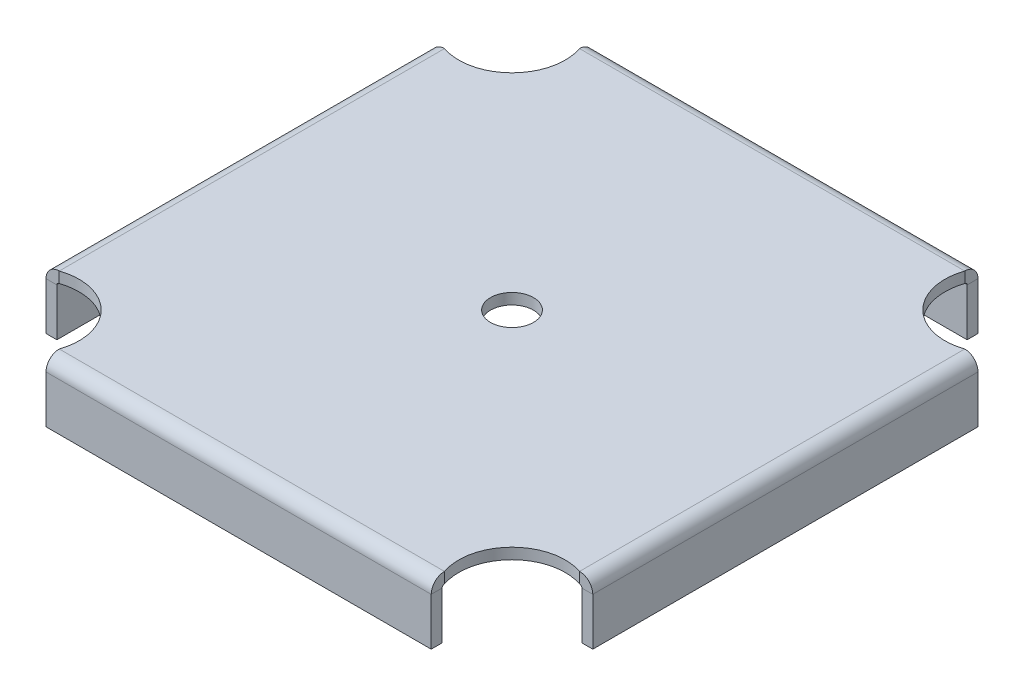
ISO-10303-21;
HEADER;
FILE_DESCRIPTION(('STEP AP214'),'2;1');
FILE_NAME('part.step','',(''),(''),'','','');
FILE_SCHEMA(('AUTOMOTIVE_DESIGN { 1 0 10303 214 1 1 1 1 }'));
ENDSEC;
DATA;
#1=APPLICATION_CONTEXT('core data for automotive mechanical design processes');
#2=APPLICATION_PROTOCOL_DEFINITION('international standard','automotive_design',2000,#1);
#3=PRODUCT_CONTEXT('',#1,'mechanical');
#4=PRODUCT('Part','Part','',(#3));
#5=PRODUCT_RELATED_PRODUCT_CATEGORY('part','',(#4));
#6=PRODUCT_DEFINITION_FORMATION('','',#4);
#7=PRODUCT_DEFINITION_CONTEXT('part definition',#1,'design');
#8=PRODUCT_DEFINITION('design','',#6,#7);
#9=PRODUCT_DEFINITION_SHAPE('','',#8);
#10=(LENGTH_UNIT() NAMED_UNIT(*) SI_UNIT(.MILLI.,.METRE.));
#11=(NAMED_UNIT(*) PLANE_ANGLE_UNIT() SI_UNIT($,.RADIAN.));
#12=(NAMED_UNIT(*) SI_UNIT($,.STERADIAN.) SOLID_ANGLE_UNIT());
#13=UNCERTAINTY_MEASURE_WITH_UNIT(LENGTH_MEASURE(1.E-05),#10,'distance_accuracy_value','');
#14=(GEOMETRIC_REPRESENTATION_CONTEXT(3) GLOBAL_UNCERTAINTY_ASSIGNED_CONTEXT((#13)) GLOBAL_UNIT_ASSIGNED_CONTEXT((#10,
#11,#12)) REPRESENTATION_CONTEXT('',''));
#15=CARTESIAN_POINT('',(0.,0.,0.));
#16=DIRECTION('',(0.,0.,1.));
#17=DIRECTION('',(1.,0.,0.));
#18=AXIS2_PLACEMENT_3D('',#15,#16,#17);
#19=CARTESIAN_POINT('',(76.2,-3.4163,76.2));
#20=DIRECTION('',(0.,1.,0.));
#21=DIRECTION('',(0.,0.,1.));
#22=AXIS2_PLACEMENT_3D('',#19,#20,#21);
#23=CYLINDRICAL_SURFACE('',#22,16.7005);
#24=CARTESIAN_POINT('',(76.2,0.,76.2));
#25=DIRECTION('',(0.,-1.,0.));
#26=DIRECTION('',(0.,0.,1.));
#27=AXIS2_PLACEMENT_3D('',#24,#25,#26);
#28=CIRCLE('',#27,16.7005);
#29=CARTESIAN_POINT('',(60.3828089759907,0.,81.5594));
#30=VERTEX_POINT('',#29);
#31=CARTESIAN_POINT('',(81.5594,0.,60.3828089759907));
#32=VERTEX_POINT('',#31);
#33=EDGE_CURVE('E465',#30,#32,#28,.T.);
#34=ORIENTED_EDGE('',*,*,#33,.F.);
#35=DIRECTION('',(0.,1.,0.));
#36=VECTOR('',#35,1.);
#37=CARTESIAN_POINT('',(60.3828089759907,-3.4163,81.5594));
#38=LINE('',#37,#36);
#39=CARTESIAN_POINT('',(60.3828089759907,-3.4163,81.5594));
#40=VERTEX_POINT('',#39);
#41=EDGE_CURVE('E13',#40,#30,#38,.T.);
#42=ORIENTED_EDGE('',*,*,#41,.F.);
#43=CARTESIAN_POINT('',(76.2,-3.4163,76.2));
#44=DIRECTION('',(0.,-1.,0.));
#45=DIRECTION('',(0.,0.,1.));
#46=AXIS2_PLACEMENT_3D('',#43,#44,#45);
#47=CIRCLE('',#46,16.7005);
#48=CARTESIAN_POINT('',(81.5594,-3.4163,60.3828089759907));
#49=VERTEX_POINT('',#48);
#50=EDGE_CURVE('E468',#40,#49,#47,.T.);
#51=ORIENTED_EDGE('',*,*,#50,.T.);
#52=DIRECTION('',(0.,1.,0.));
#53=VECTOR('',#52,1.);
#54=CARTESIAN_POINT('',(81.5594,-3.4163,60.3828089759907));
#55=LINE('',#54,#53);
#56=EDGE_CURVE('E122',#49,#32,#55,.T.);
#57=ORIENTED_EDGE('',*,*,#56,.T.);
#58=EDGE_LOOP('',(#34,#42,#51,#57));
#59=FACE_BOUND('',#58,.T.);
#60=ADVANCED_FACE('F119',(#59),#23,.F.);
#61=CARTESIAN_POINT('',(-76.2,-3.4163,76.2));
#62=DIRECTION('',(0.,1.,0.));
#63=DIRECTION('',(0.,0.,1.));
#64=AXIS2_PLACEMENT_3D('',#61,#62,#63);
#65=CYLINDRICAL_SURFACE('',#64,16.7005);
#66=CARTESIAN_POINT('',(-76.2,0.,76.2));
#67=DIRECTION('',(0.,-1.,0.));
#68=DIRECTION('',(0.,0.,1.));
#69=AXIS2_PLACEMENT_3D('',#66,#67,#68);
#70=CIRCLE('',#69,16.7005);
#71=CARTESIAN_POINT('',(-81.5594,0.,60.3828089759907));
#72=VERTEX_POINT('',#71);
#73=CARTESIAN_POINT('',(-60.3828089759907,0.,81.5594));
#74=VERTEX_POINT('',#73);
#75=EDGE_CURVE('E506',#72,#74,#70,.T.);
#76=ORIENTED_EDGE('',*,*,#75,.F.);
#77=DIRECTION('',(0.,1.,0.));
#78=VECTOR('',#77,1.);
#79=CARTESIAN_POINT('',(-81.5594,-3.4163,60.3828089759907));
#80=LINE('',#79,#78);
#81=CARTESIAN_POINT('',(-81.5594,-3.4163,60.3828089759907));
#82=VERTEX_POINT('',#81);
#83=EDGE_CURVE('E513',#82,#72,#80,.T.);
#84=ORIENTED_EDGE('',*,*,#83,.F.);
#85=CARTESIAN_POINT('',(-76.2,-3.4163,76.2));
#86=DIRECTION('',(0.,-1.,0.));
#87=DIRECTION('',(0.,0.,1.));
#88=AXIS2_PLACEMENT_3D('',#85,#86,#87);
#89=CIRCLE('',#88,16.7005);
#90=CARTESIAN_POINT('',(-60.3828089759907,-3.4163,81.5594));
#91=VERTEX_POINT('',#90);
#92=EDGE_CURVE('E484',#82,#91,#89,.T.);
#93=ORIENTED_EDGE('',*,*,#92,.T.);
#94=DIRECTION('',(0.,1.,0.));
#95=VECTOR('',#94,1.);
#96=CARTESIAN_POINT('',(-60.3828089759907,-3.4163,81.5594));
#97=LINE('',#96,#95);
#98=EDGE_CURVE('E127',#91,#74,#97,.T.);
#99=ORIENTED_EDGE('',*,*,#98,.T.);
#100=EDGE_LOOP('',(#76,#84,#93,#99));
#101=FACE_BOUND('',#100,.T.);
#102=ADVANCED_FACE('F545',(#101),#65,.F.);
#103=CARTESIAN_POINT('',(-76.2,-3.4163,-76.2));
#104=DIRECTION('',(0.,1.,0.));
#105=DIRECTION('',(0.,0.,1.));
#106=AXIS2_PLACEMENT_3D('',#103,#104,#105);
#107=CYLINDRICAL_SURFACE('',#106,16.7005);
#108=CARTESIAN_POINT('',(-76.2,0.,-76.2));
#109=DIRECTION('',(0.,-1.,0.));
#110=DIRECTION('',(0.,0.,1.));
#111=AXIS2_PLACEMENT_3D('',#108,#109,#110);
#112=CIRCLE('',#111,16.7005);
#113=CARTESIAN_POINT('',(-60.3828089759907,0.,-81.5594));
#114=VERTEX_POINT('',#113);
#115=CARTESIAN_POINT('',(-81.5594,0.,-60.3828089759907));
#116=VERTEX_POINT('',#115);
#117=EDGE_CURVE('E500',#114,#116,#112,.T.);
#118=ORIENTED_EDGE('',*,*,#117,.F.);
#119=DIRECTION('',(0.,1.,0.));
#120=VECTOR('',#119,1.);
#121=CARTESIAN_POINT('',(-60.3828089759907,-3.4163,-81.5594));
#122=LINE('',#121,#120);
#123=CARTESIAN_POINT('',(-60.3828089759907,-3.41630000000001,-81.5594));
#124=VERTEX_POINT('',#123);
#125=EDGE_CURVE('E518',#124,#114,#122,.T.);
#126=ORIENTED_EDGE('',*,*,#125,.F.);
#127=CARTESIAN_POINT('',(-76.2,-3.4163,-76.2));
#128=DIRECTION('',(0.,-1.,0.));
#129=DIRECTION('',(0.,0.,1.));
#130=AXIS2_PLACEMENT_3D('',#127,#128,#129);
#131=CIRCLE('',#130,16.7005);
#132=CARTESIAN_POINT('',(-81.5594,-3.4163,-60.3828089759907));
#133=VERTEX_POINT('',#132);
#134=EDGE_CURVE('E479',#124,#133,#131,.T.);
#135=ORIENTED_EDGE('',*,*,#134,.T.);
#136=DIRECTION('',(0.,1.,0.));
#137=VECTOR('',#136,1.);
#138=CARTESIAN_POINT('',(-81.5594,-3.4163,-60.3828089759907));
#139=LINE('',#138,#137);
#140=EDGE_CURVE('E515',#133,#116,#139,.T.);
#141=ORIENTED_EDGE('',*,*,#140,.T.);
#142=EDGE_LOOP('',(#118,#126,#135,#141));
#143=FACE_BOUND('',#142,.T.);
#144=ADVANCED_FACE('F591',(#143),#107,.F.);
#145=CARTESIAN_POINT('',(76.2,-3.4163,-76.2));
#146=DIRECTION('',(0.,1.,0.));
#147=DIRECTION('',(0.,0.,1.));
#148=AXIS2_PLACEMENT_3D('',#145,#146,#147);
#149=CYLINDRICAL_SURFACE('',#148,16.7005);
#150=CARTESIAN_POINT('',(76.2,0.,-76.2));
#151=DIRECTION('',(0.,-1.,0.));
#152=DIRECTION('',(0.,0.,1.));
#153=AXIS2_PLACEMENT_3D('',#150,#151,#152);
#154=CIRCLE('',#153,16.7005);
#155=CARTESIAN_POINT('',(81.5594,0.,-60.3828089759907));
#156=VERTEX_POINT('',#155);
#157=CARTESIAN_POINT('',(60.3828089759907,0.,-81.5594));
#158=VERTEX_POINT('',#157);
#159=EDGE_CURVE('E494',#156,#158,#154,.T.);
#160=ORIENTED_EDGE('',*,*,#159,.F.);
#161=DIRECTION('',(0.,1.,0.));
#162=VECTOR('',#161,1.);
#163=CARTESIAN_POINT('',(81.5594,-3.4163,-60.3828089759907));
#164=LINE('',#163,#162);
#165=CARTESIAN_POINT('',(81.5594,-3.4163,-60.3828089759907));
#166=VERTEX_POINT('',#165);
#167=EDGE_CURVE('E523',#166,#156,#164,.T.);
#168=ORIENTED_EDGE('',*,*,#167,.F.);
#169=CARTESIAN_POINT('',(76.2,-3.4163,-76.2));
#170=DIRECTION('',(0.,-1.,0.));
#171=DIRECTION('',(0.,0.,1.));
#172=AXIS2_PLACEMENT_3D('',#169,#170,#171);
#173=CIRCLE('',#172,16.7005);
#174=CARTESIAN_POINT('',(60.3828089759907,-3.41630000000001,-81.5594));
#175=VERTEX_POINT('',#174);
#176=EDGE_CURVE('E474',#166,#175,#173,.T.);
#177=ORIENTED_EDGE('',*,*,#176,.T.);
#178=DIRECTION('',(0.,1.,0.));
#179=VECTOR('',#178,1.);
#180=CARTESIAN_POINT('',(60.3828089759907,-3.4163,-81.5594));
#181=LINE('',#180,#179);
#182=EDGE_CURVE('E521',#175,#158,#181,.T.);
#183=ORIENTED_EDGE('',*,*,#182,.T.);
#184=EDGE_LOOP('',(#160,#168,#177,#183));
#185=FACE_BOUND('',#184,.T.);
#186=ADVANCED_FACE('F596',(#185),#149,.F.);
#187=CARTESIAN_POINT('',(76.2,-3.4163,76.2));
#188=DIRECTION('',(0.,1.,0.));
#189=DIRECTION('',(0.,0.,1.));
#190=AXIS2_PLACEMENT_3D('',#187,#188,#189);
#191=PLANE('',#190);
#192=CARTESIAN_POINT('',(0.,-3.4163,0.));
#193=DIRECTION('',(0.,1.,0.));
#194=DIRECTION('',(0.,0.,1.));
#195=AXIS2_PLACEMENT_3D('',#192,#193,#194);
#196=CIRCLE('',#195,6.7437);
#197=CARTESIAN_POINT('',(0.,-3.4163,6.7437));
#198=VERTEX_POINT('',#197);
#199=EDGE_CURVE('E462',#198,#198,#196,.T.);
#200=ORIENTED_EDGE('',*,*,#199,.T.);
#201=EDGE_LOOP('',(#200));
#202=FACE_BOUND('',#201,.T.);
#203=ORIENTED_EDGE('',*,*,#50,.F.);
#204=DIRECTION('',(1.,0.,0.));
#205=VECTOR('',#204,1.);
#206=CARTESIAN_POINT('',(60.3828089759907,-3.4163,81.5594));
#207=LINE('',#206,#205);
#208=EDGE_CURVE('E487',#91,#40,#207,.T.);
#209=ORIENTED_EDGE('',*,*,#208,.F.);
#210=ORIENTED_EDGE('',*,*,#92,.F.);
#211=DIRECTION('',(0.,0.,1.));
#212=VECTOR('',#211,1.);
#213=CARTESIAN_POINT('',(-81.5594,-3.4163,60.3828089759907));
#214=LINE('',#213,#212);
#215=EDGE_CURVE('E482',#133,#82,#214,.T.);
#216=ORIENTED_EDGE('',*,*,#215,.F.);
#217=ORIENTED_EDGE('',*,*,#134,.F.);
#218=DIRECTION('',(-1.,0.,0.));
#219=VECTOR('',#218,1.);
#220=CARTESIAN_POINT('',(-60.3828089759907,-3.4163,-81.5594));
#221=LINE('',#220,#219);
#222=EDGE_CURVE('E477',#175,#124,#221,.T.);
#223=ORIENTED_EDGE('',*,*,#222,.F.);
#224=ORIENTED_EDGE('',*,*,#176,.F.);
#225=DIRECTION('',(0.,0.,-1.));
#226=VECTOR('',#225,1.);
#227=CARTESIAN_POINT('',(81.5594,-3.4163,-60.3828089759907));
#228=LINE('',#227,#226);
#229=EDGE_CURVE('E471',#49,#166,#228,.T.);
#230=ORIENTED_EDGE('',*,*,#229,.F.);
#231=EDGE_LOOP('',(#203,#209,#210,#216,#217,#223,#224,#230));
#232=FACE_BOUND('',#231,.T.);
#233=ADVANCED_FACE('F551',(#202,#232),#191,.F.);
#234=CARTESIAN_POINT('',(76.2,0.,76.2));
#235=DIRECTION('',(0.,1.,0.));
#236=DIRECTION('',(0.,0.,1.));
#237=AXIS2_PLACEMENT_3D('',#234,#235,#236);
#238=PLANE('',#237);
#239=CARTESIAN_POINT('',(0.,0.,0.));
#240=DIRECTION('',(0.,1.,0.));
#241=DIRECTION('',(0.,0.,1.));
#242=AXIS2_PLACEMENT_3D('',#239,#240,#241);
#243=CIRCLE('',#242,6.7437);
#244=CARTESIAN_POINT('',(0.,0.,6.7437));
#245=VERTEX_POINT('',#244);
#246=EDGE_CURVE('E453',#245,#245,#243,.T.);
#247=ORIENTED_EDGE('',*,*,#246,.F.);
#248=EDGE_LOOP('',(#247));
#249=FACE_BOUND('',#248,.T.);
#250=ORIENTED_EDGE('',*,*,#33,.T.);
#251=DIRECTION('',(0.,0.,-1.));
#252=VECTOR('',#251,1.);
#253=CARTESIAN_POINT('',(81.5594,0.,-60.3828089759907));
#254=LINE('',#253,#252);
#255=EDGE_CURVE('E491',#32,#156,#254,.T.);
#256=ORIENTED_EDGE('',*,*,#255,.T.);
#257=ORIENTED_EDGE('',*,*,#159,.T.);
#258=DIRECTION('',(-1.,0.,0.));
#259=VECTOR('',#258,1.);
#260=CARTESIAN_POINT('',(-60.3828089759907,0.,-81.5594));
#261=LINE('',#260,#259);
#262=EDGE_CURVE('E497',#158,#114,#261,.T.);
#263=ORIENTED_EDGE('',*,*,#262,.T.);
#264=ORIENTED_EDGE('',*,*,#117,.T.);
#265=DIRECTION('',(0.,0.,1.));
#266=VECTOR('',#265,1.);
#267=CARTESIAN_POINT('',(-81.5594,0.,60.3828089759907));
#268=LINE('',#267,#266);
#269=EDGE_CURVE('E503',#116,#72,#268,.T.);
#270=ORIENTED_EDGE('',*,*,#269,.T.);
#271=ORIENTED_EDGE('',*,*,#75,.T.);
#272=DIRECTION('',(1.,0.,0.));
#273=VECTOR('',#272,1.);
#274=CARTESIAN_POINT('',(60.3828089759907,0.,81.5594));
#275=LINE('',#274,#273);
#276=EDGE_CURVE('E472',#74,#30,#275,.T.);
#277=ORIENTED_EDGE('',*,*,#276,.T.);
#278=EDGE_LOOP('',(#250,#256,#257,#263,#264,#270,#271,#277));
#279=FACE_BOUND('',#278,.T.);
#280=ADVANCED_FACE('F537',(#249,#279),#238,.T.);
#281=CARTESIAN_POINT('',(0.,-3.4163,0.));
#282=DIRECTION('',(0.,1.,0.));
#283=DIRECTION('',(0.,0.,1.));
#284=AXIS2_PLACEMENT_3D('',#281,#282,#283);
#285=CYLINDRICAL_SURFACE('',#284,6.7437);
#286=ORIENTED_EDGE('',*,*,#199,.F.);
#287=EDGE_LOOP('',(#286));
#288=FACE_BOUND('',#287,.T.);
#289=ORIENTED_EDGE('',*,*,#246,.T.);
#290=EDGE_LOOP('',(#289));
#291=FACE_BOUND('',#290,.T.);
#292=ADVANCED_FACE('F710',(#288,#291),#285,.F.);
#293=CARTESIAN_POINT('',(60.3828089759907,-4.1529,81.5594));
#294=DIRECTION('',(1.,0.,0.));
#295=DIRECTION('',(0.,0.,-1.));
#296=AXIS2_PLACEMENT_3D('',#293,#294,#295);
#297=PLANE('',#296);
#298=DIRECTION('',(0.,0.,1.));
#299=VECTOR('',#298,1.);
#300=CARTESIAN_POINT('',(60.3828089759907,-4.1529,85.7123));
#301=LINE('',#300,#299);
#302=CARTESIAN_POINT('',(60.3828089759907,-4.1529,82.296));
#303=VERTEX_POINT('',#302);
#304=CARTESIAN_POINT('',(60.3828089759907,-4.15289999999999,85.7123));
#305=VERTEX_POINT('',#304);
#306=EDGE_CURVE('E411',#303,#305,#301,.T.);
#307=ORIENTED_EDGE('',*,*,#306,.F.);
#308=CARTESIAN_POINT('',(60.3828089759907,-4.1529,81.5594));
#309=DIRECTION('',(-1.,0.,0.));
#310=DIRECTION('',(0.,0.,1.));
#311=AXIS2_PLACEMENT_3D('',#308,#309,#310);
#312=CIRCLE('',#311,0.736600000000004);
#313=EDGE_CURVE('E457',#40,#303,#312,.F.);
#314=ORIENTED_EDGE('',*,*,#313,.F.);
#315=ORIENTED_EDGE('',*,*,#41,.T.);
#316=CARTESIAN_POINT('',(60.3828089759907,-4.1529,81.5594));
#317=DIRECTION('',(-1.,0.,0.));
#318=DIRECTION('',(0.,0.,1.));
#319=AXIS2_PLACEMENT_3D('',#316,#317,#318);
#320=CIRCLE('',#319,4.1529);
#321=EDGE_CURVE('E135',#30,#305,#320,.F.);
#322=ORIENTED_EDGE('',*,*,#321,.T.);
#323=EDGE_LOOP('',(#307,#314,#315,#322));
#324=FACE_BOUND('',#323,.T.);
#325=ADVANCED_FACE('F558',(#324),#297,.T.);
#326=CARTESIAN_POINT('',(-60.3828089759907,-4.1529,81.5594));
#327=DIRECTION('',(1.,0.,0.));
#328=DIRECTION('',(0.,0.,-1.));
#329=AXIS2_PLACEMENT_3D('',#326,#327,#328);
#330=PLANE('',#329);
#331=CARTESIAN_POINT('',(-60.3828089759907,-4.1529,81.5594));
#332=DIRECTION('',(-1.,0.,0.));
#333=DIRECTION('',(0.,0.,1.));
#334=AXIS2_PLACEMENT_3D('',#331,#332,#333);
#335=CIRCLE('',#334,0.736600000000004);
#336=CARTESIAN_POINT('',(-60.3828089759907,-4.1529,82.296));
#337=VERTEX_POINT('',#336);
#338=EDGE_CURVE('E422',#337,#91,#335,.T.);
#339=ORIENTED_EDGE('',*,*,#338,.F.);
#340=DIRECTION('',(0.,0.,1.));
#341=VECTOR('',#340,1.);
#342=CARTESIAN_POINT('',(-60.3828089759907,-4.1529,82.296));
#343=LINE('',#342,#341);
#344=CARTESIAN_POINT('',(-60.3828089759907,-4.1529,85.7123));
#345=VERTEX_POINT('',#344);
#346=EDGE_CURVE('E445',#337,#345,#343,.T.);
#347=ORIENTED_EDGE('',*,*,#346,.T.);
#348=CARTESIAN_POINT('',(-60.3828089759907,-4.1529,81.5594));
#349=DIRECTION('',(-1.,0.,0.));
#350=DIRECTION('',(0.,0.,1.));
#351=AXIS2_PLACEMENT_3D('',#348,#349,#350);
#352=CIRCLE('',#351,4.1529);
#353=EDGE_CURVE('E454',#345,#74,#352,.T.);
#354=ORIENTED_EDGE('',*,*,#353,.T.);
#355=ORIENTED_EDGE('',*,*,#98,.F.);
#356=EDGE_LOOP('',(#339,#347,#354,#355));
#357=FACE_BOUND('',#356,.T.);
#358=ADVANCED_FACE('F542',(#357),#330,.F.);
#359=CARTESIAN_POINT('',(-60.3828089759907,-4.1529,81.5594));
#360=DIRECTION('',(-1.,0.,0.));
#361=DIRECTION('',(0.,0.,1.));
#362=AXIS2_PLACEMENT_3D('',#359,#360,#361);
#363=CYLINDRICAL_SURFACE('',#362,4.1529);
#364=ORIENTED_EDGE('',*,*,#276,.F.);
#365=ORIENTED_EDGE('',*,*,#353,.F.);
#366=DIRECTION('',(-1.,0.,0.));
#367=VECTOR('',#366,1.);
#368=CARTESIAN_POINT('',(0.,-4.1529,85.7123));
#369=LINE('',#368,#367);
#370=EDGE_CURVE('E442',#305,#345,#369,.T.);
#371=ORIENTED_EDGE('',*,*,#370,.F.);
#372=ORIENTED_EDGE('',*,*,#321,.F.);
#373=EDGE_LOOP('',(#364,#365,#371,#372));
#374=FACE_BOUND('',#373,.T.);
#375=ADVANCED_FACE('F539',(#374),#363,.T.);
#376=CARTESIAN_POINT('',(-60.3828089759907,-4.1529,81.5594));
#377=DIRECTION('',(-1.,0.,0.));
#378=DIRECTION('',(0.,0.,1.));
#379=AXIS2_PLACEMENT_3D('',#376,#377,#378);
#380=CYLINDRICAL_SURFACE('',#379,0.736600000000004);
#381=ORIENTED_EDGE('',*,*,#208,.T.);
#382=ORIENTED_EDGE('',*,*,#313,.T.);
#383=DIRECTION('',(1.,0.,0.));
#384=VECTOR('',#383,1.);
#385=CARTESIAN_POINT('',(60.3828089759907,-4.1529,82.296));
#386=LINE('',#385,#384);
#387=EDGE_CURVE('E448',#303,#337,#386,.F.);
#388=ORIENTED_EDGE('',*,*,#387,.T.);
#389=ORIENTED_EDGE('',*,*,#338,.T.);
#390=EDGE_LOOP('',(#381,#382,#388,#389));
#391=FACE_BOUND('',#390,.T.);
#392=ADVANCED_FACE('F555',(#391),#380,.F.);
#393=CARTESIAN_POINT('',(-60.3828089759907,-3.41629999999999,85.7123));
#394=DIRECTION('',(-1.,0.,0.));
#395=DIRECTION('',(0.,0.,1.));
#396=AXIS2_PLACEMENT_3D('',#393,#394,#395);
#397=PLANE('',#396);
#398=DIRECTION('',(0.,1.,0.));
#399=VECTOR('',#398,1.);
#400=CARTESIAN_POINT('',(-60.3828089759907,-3.41629999999999,85.7123));
#401=LINE('',#400,#399);
#402=CARTESIAN_POINT('',(-60.3828089759907,-19.05,85.7123));
#403=VERTEX_POINT('',#402);
#404=EDGE_CURVE('E426',#403,#345,#401,.T.);
#405=ORIENTED_EDGE('',*,*,#404,.T.);
#406=ORIENTED_EDGE('',*,*,#346,.F.);
#407=DIRECTION('',(0.,-1.,0.));
#408=VECTOR('',#407,1.);
#409=CARTESIAN_POINT('',(-60.3828089759907,2.17196961742773E-13,82.296));
#410=LINE('',#409,#408);
#411=CARTESIAN_POINT('',(-60.3828089759907,-19.05,82.296));
#412=VERTEX_POINT('',#411);
#413=EDGE_CURVE('E434',#412,#337,#410,.F.);
#414=ORIENTED_EDGE('',*,*,#413,.F.);
#415=DIRECTION('',(0.,0.,-1.));
#416=VECTOR('',#415,1.);
#417=CARTESIAN_POINT('',(-60.3828089759907,-19.05,85.7123));
#418=LINE('',#417,#416);
#419=EDGE_CURVE('E420',#403,#412,#418,.T.);
#420=ORIENTED_EDGE('',*,*,#419,.F.);
#421=EDGE_LOOP('',(#405,#406,#414,#420));
#422=FACE_BOUND('',#421,.T.);
#423=ADVANCED_FACE('F575',(#422),#397,.T.);
#424=CARTESIAN_POINT('',(60.3828089759907,-19.05,85.7123));
#425=DIRECTION('',(1.,0.,0.));
#426=DIRECTION('',(0.,0.,-1.));
#427=AXIS2_PLACEMENT_3D('',#424,#425,#426);
#428=PLANE('',#427);
#429=DIRECTION('',(0.,1.,0.));
#430=VECTOR('',#429,1.);
#431=CARTESIAN_POINT('',(60.3828089759907,2.17196961742773E-13,82.296));
#432=LINE('',#431,#430);
#433=CARTESIAN_POINT('',(60.3828089759907,-19.05,82.296));
#434=VERTEX_POINT('',#433);
#435=EDGE_CURVE('E440',#303,#434,#432,.F.);
#436=ORIENTED_EDGE('',*,*,#435,.F.);
#437=ORIENTED_EDGE('',*,*,#306,.T.);
#438=DIRECTION('',(0.,-1.,0.));
#439=VECTOR('',#438,1.);
#440=CARTESIAN_POINT('',(60.3828089759907,-19.05,85.7123));
#441=LINE('',#440,#439);
#442=CARTESIAN_POINT('',(60.3828089759907,-19.05,85.7123));
#443=VERTEX_POINT('',#442);
#444=EDGE_CURVE('E432',#305,#443,#441,.T.);
#445=ORIENTED_EDGE('',*,*,#444,.T.);
#446=DIRECTION('',(0.,0.,-1.));
#447=VECTOR('',#446,1.);
#448=CARTESIAN_POINT('',(60.3828089759907,-19.05,85.7123));
#449=LINE('',#448,#447);
#450=EDGE_CURVE('E423',#443,#434,#449,.T.);
#451=ORIENTED_EDGE('',*,*,#450,.T.);
#452=EDGE_LOOP('',(#436,#437,#445,#451));
#453=FACE_BOUND('',#452,.T.);
#454=ADVANCED_FACE('F562',(#453),#428,.T.);
#455=CARTESIAN_POINT('',(0.,2.29124909440663E-13,85.7123));
#456=DIRECTION('',(0.,0.,1.));
#457=DIRECTION('',(0.,-1.,0.));
#458=AXIS2_PLACEMENT_3D('',#455,#456,#457);
#459=PLANE('',#458);
#460=ORIENTED_EDGE('',*,*,#444,.F.);
#461=ORIENTED_EDGE('',*,*,#370,.T.);
#462=ORIENTED_EDGE('',*,*,#404,.F.);
#463=DIRECTION('',(-1.,0.,0.));
#464=VECTOR('',#463,1.);
#465=CARTESIAN_POINT('',(-60.3828089759907,-19.05,85.7123));
#466=LINE('',#465,#464);
#467=EDGE_CURVE('E429',#443,#403,#466,.T.);
#468=ORIENTED_EDGE('',*,*,#467,.F.);
#469=EDGE_LOOP('',(#460,#461,#462,#468));
#470=FACE_BOUND('',#469,.T.);
#471=ADVANCED_FACE('F566',(#470),#459,.T.);
#472=CARTESIAN_POINT('',(0.,2.17196961742773E-13,82.296));
#473=DIRECTION('',(0.,0.,1.));
#474=DIRECTION('',(0.,-1.,0.));
#475=AXIS2_PLACEMENT_3D('',#472,#473,#474);
#476=PLANE('',#475);
#477=ORIENTED_EDGE('',*,*,#387,.F.);
#478=ORIENTED_EDGE('',*,*,#435,.T.);
#479=DIRECTION('',(1.,0.,0.));
#480=VECTOR('',#479,1.);
#481=CARTESIAN_POINT('',(0.,-19.05,82.296));
#482=LINE('',#481,#480);
#483=EDGE_CURVE('E437',#434,#412,#482,.F.);
#484=ORIENTED_EDGE('',*,*,#483,.T.);
#485=ORIENTED_EDGE('',*,*,#413,.T.);
#486=EDGE_LOOP('',(#477,#478,#484,#485));
#487=FACE_BOUND('',#486,.T.);
#488=ADVANCED_FACE('F573',(#487),#476,.F.);
#489=CARTESIAN_POINT('',(-60.3828089759907,-19.05,85.7123));
#490=DIRECTION('',(0.,-1.,0.));
#491=DIRECTION('',(0.,0.,-1.));
#492=AXIS2_PLACEMENT_3D('',#489,#490,#491);
#493=PLANE('',#492);
#494=ORIENTED_EDGE('',*,*,#483,.F.);
#495=ORIENTED_EDGE('',*,*,#450,.F.);
#496=ORIENTED_EDGE('',*,*,#467,.T.);
#497=ORIENTED_EDGE('',*,*,#419,.T.);
#498=EDGE_LOOP('',(#494,#495,#496,#497));
#499=FACE_BOUND('',#498,.T.);
#500=ADVANCED_FACE('F570',(#499),#493,.T.);
#501=CARTESIAN_POINT('',(81.5594,-4.1529,-60.3828089759907));
#502=DIRECTION('',(0.,0.,-1.));
#503=DIRECTION('',(-1.,0.,0.));
#504=AXIS2_PLACEMENT_3D('',#501,#502,#503);
#505=PLANE('',#504);
#506=DIRECTION('',(1.,0.,0.));
#507=VECTOR('',#506,1.);
#508=CARTESIAN_POINT('',(85.7123,-4.15289999999999,-60.3828089759907));
#509=LINE('',#508,#507);
#510=CARTESIAN_POINT('',(82.296,-4.1529,-60.3828089759907));
#511=VERTEX_POINT('',#510);
#512=CARTESIAN_POINT('',(85.7123,-4.15289999999999,-60.3828089759907));
#513=VERTEX_POINT('',#512);
#514=EDGE_CURVE('E368',#511,#513,#509,.T.);
#515=ORIENTED_EDGE('',*,*,#514,.F.);
#516=CARTESIAN_POINT('',(81.5594,-4.1529,-60.3828089759907));
#517=DIRECTION('',(0.,0.,1.));
#518=DIRECTION('',(1.,0.,0.));
#519=AXIS2_PLACEMENT_3D('',#516,#517,#518);
#520=CIRCLE('',#519,0.736600000000004);
#521=EDGE_CURVE('E415',#166,#511,#520,.F.);
#522=ORIENTED_EDGE('',*,*,#521,.F.);
#523=ORIENTED_EDGE('',*,*,#167,.T.);
#524=CARTESIAN_POINT('',(81.5594,-4.1529,-60.3828089759907));
#525=DIRECTION('',(0.,0.,1.));
#526=DIRECTION('',(1.,0.,0.));
#527=AXIS2_PLACEMENT_3D('',#524,#525,#526);
#528=CIRCLE('',#527,4.1529);
#529=EDGE_CURVE('E408',#156,#513,#528,.F.);
#530=ORIENTED_EDGE('',*,*,#529,.T.);
#531=EDGE_LOOP('',(#515,#522,#523,#530));
#532=FACE_BOUND('',#531,.T.);
#533=ADVANCED_FACE('F693',(#532),#505,.T.);
#534=CARTESIAN_POINT('',(81.5594,-4.1529,60.3828089759907));
#535=DIRECTION('',(0.,0.,-1.));
#536=DIRECTION('',(-1.,0.,0.));
#537=AXIS2_PLACEMENT_3D('',#534,#535,#536);
#538=PLANE('',#537);
#539=CARTESIAN_POINT('',(81.5594,-4.1529,60.3828089759907));
#540=DIRECTION('',(0.,0.,1.));
#541=DIRECTION('',(1.,0.,0.));
#542=AXIS2_PLACEMENT_3D('',#539,#540,#541);
#543=CIRCLE('',#542,0.736600000000004);
#544=CARTESIAN_POINT('',(82.296,-4.1529,60.3828089759907));
#545=VERTEX_POINT('',#544);
#546=EDGE_CURVE('E379',#545,#49,#543,.T.);
#547=ORIENTED_EDGE('',*,*,#546,.F.);
#548=DIRECTION('',(1.,0.,0.));
#549=VECTOR('',#548,1.);
#550=CARTESIAN_POINT('',(82.296,-4.1529,60.3828089759907));
#551=LINE('',#550,#549);
#552=CARTESIAN_POINT('',(85.7123,-4.15289999999999,60.3828089759907));
#553=VERTEX_POINT('',#552);
#554=EDGE_CURVE('E401',#545,#553,#551,.T.);
#555=ORIENTED_EDGE('',*,*,#554,.T.);
#556=CARTESIAN_POINT('',(81.5594,-4.1529,60.3828089759907));
#557=DIRECTION('',(0.,0.,1.));
#558=DIRECTION('',(1.,0.,0.));
#559=AXIS2_PLACEMENT_3D('',#556,#557,#558);
#560=CIRCLE('',#559,4.1529);
#561=EDGE_CURVE('E412',#553,#32,#560,.T.);
#562=ORIENTED_EDGE('',*,*,#561,.T.);
#563=ORIENTED_EDGE('',*,*,#56,.F.);
#564=EDGE_LOOP('',(#547,#555,#562,#563));
#565=FACE_BOUND('',#564,.T.);
#566=ADVANCED_FACE('F688',(#565),#538,.F.);
#567=CARTESIAN_POINT('',(81.5594,-4.1529,60.3828089759907));
#568=DIRECTION('',(0.,0.,1.));
#569=DIRECTION('',(1.,0.,0.));
#570=AXIS2_PLACEMENT_3D('',#567,#568,#569);
#571=CYLINDRICAL_SURFACE('',#570,4.1529);
#572=ORIENTED_EDGE('',*,*,#255,.F.);
#573=ORIENTED_EDGE('',*,*,#561,.F.);
#574=DIRECTION('',(0.,0.,1.));
#575=VECTOR('',#574,1.);
#576=CARTESIAN_POINT('',(85.7123,-4.15289999999999,-60.3828089759907));
#577=LINE('',#576,#575);
#578=EDGE_CURVE('E399',#553,#513,#577,.F.);
#579=ORIENTED_EDGE('',*,*,#578,.T.);
#580=ORIENTED_EDGE('',*,*,#529,.F.);
#581=EDGE_LOOP('',(#572,#573,#579,#580));
#582=FACE_BOUND('',#581,.T.);
#583=ADVANCED_FACE('F685',(#582),#571,.T.);
#584=CARTESIAN_POINT('',(81.5594,-4.1529,60.3828089759907));
#585=DIRECTION('',(0.,0.,1.));
#586=DIRECTION('',(1.,0.,0.));
#587=AXIS2_PLACEMENT_3D('',#584,#585,#586);
#588=CYLINDRICAL_SURFACE('',#587,0.736600000000004);
#589=ORIENTED_EDGE('',*,*,#229,.T.);
#590=ORIENTED_EDGE('',*,*,#521,.T.);
#591=DIRECTION('',(0.,0.,1.));
#592=VECTOR('',#591,1.);
#593=CARTESIAN_POINT('',(82.296,-4.1529,-60.3828089759907));
#594=LINE('',#593,#592);
#595=EDGE_CURVE('E404',#511,#545,#594,.T.);
#596=ORIENTED_EDGE('',*,*,#595,.T.);
#597=ORIENTED_EDGE('',*,*,#546,.T.);
#598=EDGE_LOOP('',(#589,#590,#596,#597));
#599=FACE_BOUND('',#598,.T.);
#600=ADVANCED_FACE('F683',(#599),#588,.F.);
#601=CARTESIAN_POINT('',(85.7123,-3.41629999999999,-60.3828089759907));
#602=DIRECTION('',(0.,0.,-1.));
#603=DIRECTION('',(-1.,0.,0.));
#604=AXIS2_PLACEMENT_3D('',#601,#602,#603);
#605=PLANE('',#604);
#606=DIRECTION('',(0.,-1.,0.));
#607=VECTOR('',#606,1.);
#608=CARTESIAN_POINT('',(82.296,2.89595948990364E-13,-60.3828089759907));
#609=LINE('',#608,#607);
#610=CARTESIAN_POINT('',(82.2960000000001,-19.05,-60.3828089759907));
#611=VERTEX_POINT('',#610);
#612=EDGE_CURVE('E397',#511,#611,#609,.T.);
#613=ORIENTED_EDGE('',*,*,#612,.F.);
#614=ORIENTED_EDGE('',*,*,#514,.T.);
#615=DIRECTION('',(0.,1.,0.));
#616=VECTOR('',#615,1.);
#617=CARTESIAN_POINT('',(85.7123,-3.41629999999999,-60.3828089759907));
#618=LINE('',#617,#616);
#619=CARTESIAN_POINT('',(85.7123000000001,-19.05,-60.3828089759907));
#620=VERTEX_POINT('',#619);
#621=EDGE_CURVE('E389',#513,#620,#618,.F.);
#622=ORIENTED_EDGE('',*,*,#621,.T.);
#623=DIRECTION('',(-1.,0.,0.));
#624=VECTOR('',#623,1.);
#625=CARTESIAN_POINT('',(85.7123000000001,-19.05,-60.3828089759907));
#626=LINE('',#625,#624);
#627=EDGE_CURVE('E380',#620,#611,#626,.T.);
#628=ORIENTED_EDGE('',*,*,#627,.T.);
#629=EDGE_LOOP('',(#613,#614,#622,#628));
#630=FACE_BOUND('',#629,.T.);
#631=ADVANCED_FACE('F676',(#630),#605,.T.);
#632=CARTESIAN_POINT('',(85.7123000000001,-19.05,60.3828089759907));
#633=DIRECTION('',(0.,0.,1.));
#634=DIRECTION('',(0.,-1.,0.));
#635=AXIS2_PLACEMENT_3D('',#632,#633,#634);
#636=PLANE('',#635);
#637=DIRECTION('',(0.,-1.,0.));
#638=VECTOR('',#637,1.);
#639=CARTESIAN_POINT('',(85.7123000000001,-19.05,60.3828089759907));
#640=LINE('',#639,#638);
#641=CARTESIAN_POINT('',(85.7123000000001,-19.05,60.3828089759907));
#642=VERTEX_POINT('',#641);
#643=EDGE_CURVE('E383',#642,#553,#640,.F.);
#644=ORIENTED_EDGE('',*,*,#643,.T.);
#645=ORIENTED_EDGE('',*,*,#554,.F.);
#646=DIRECTION('',(0.,1.,0.));
#647=VECTOR('',#646,1.);
#648=CARTESIAN_POINT('',(82.296,3.16396380436809E-13,60.3828089759907));
#649=LINE('',#648,#647);
#650=CARTESIAN_POINT('',(82.2960000000001,-19.05,60.3828089759907));
#651=VERTEX_POINT('',#650);
#652=EDGE_CURVE('E391',#651,#545,#649,.T.);
#653=ORIENTED_EDGE('',*,*,#652,.F.);
#654=DIRECTION('',(-1.,0.,0.));
#655=VECTOR('',#654,1.);
#656=CARTESIAN_POINT('',(85.7123000000001,-19.05,60.3828089759907));
#657=LINE('',#656,#655);
#658=EDGE_CURVE('E377',#642,#651,#657,.T.);
#659=ORIENTED_EDGE('',*,*,#658,.F.);
#660=EDGE_LOOP('',(#644,#645,#653,#659));
#661=FACE_BOUND('',#660,.T.);
#662=ADVANCED_FACE('F669',(#661),#636,.T.);
#663=CARTESIAN_POINT('',(85.7123,3.01523896688254E-13,0.));
#664=DIRECTION('',(-1.,0.,0.));
#665=DIRECTION('',(0.,-1.,0.));
#666=AXIS2_PLACEMENT_3D('',#663,#664,#665);
#667=PLANE('',#666);
#668=ORIENTED_EDGE('',*,*,#578,.F.);
#669=ORIENTED_EDGE('',*,*,#643,.F.);
#670=DIRECTION('',(0.,0.,-1.));
#671=VECTOR('',#670,1.);
#672=CARTESIAN_POINT('',(85.7123000000001,-19.05,-60.3828089759907));
#673=LINE('',#672,#671);
#674=EDGE_CURVE('E386',#620,#642,#673,.F.);
#675=ORIENTED_EDGE('',*,*,#674,.F.);
#676=ORIENTED_EDGE('',*,*,#621,.F.);
#677=EDGE_LOOP('',(#668,#669,#675,#676));
#678=FACE_BOUND('',#677,.T.);
#679=ADVANCED_FACE('F665',(#678),#667,.F.);
#680=CARTESIAN_POINT('',(82.296,2.89595948990364E-13,0.));
#681=DIRECTION('',(-1.,0.,0.));
#682=DIRECTION('',(0.,-1.,0.));
#683=AXIS2_PLACEMENT_3D('',#680,#681,#682);
#684=PLANE('',#683);
#685=ORIENTED_EDGE('',*,*,#652,.T.);
#686=ORIENTED_EDGE('',*,*,#595,.F.);
#687=ORIENTED_EDGE('',*,*,#612,.T.);
#688=DIRECTION('',(0.,0.,1.));
#689=VECTOR('',#688,1.);
#690=CARTESIAN_POINT('',(82.2960000000001,-19.05,0.));
#691=LINE('',#690,#689);
#692=EDGE_CURVE('E394',#611,#651,#691,.T.);
#693=ORIENTED_EDGE('',*,*,#692,.T.);
#694=EDGE_LOOP('',(#685,#686,#687,#693));
#695=FACE_BOUND('',#694,.T.);
#696=ADVANCED_FACE('F668',(#695),#684,.T.);
#697=CARTESIAN_POINT('',(85.7123000000001,-19.05,-60.3828089759907));
#698=DIRECTION('',(0.,-1.,0.));
#699=DIRECTION('',(1.,0.,0.));
#700=AXIS2_PLACEMENT_3D('',#697,#698,#699);
#701=PLANE('',#700);
#702=ORIENTED_EDGE('',*,*,#692,.F.);
#703=ORIENTED_EDGE('',*,*,#627,.F.);
#704=ORIENTED_EDGE('',*,*,#674,.T.);
#705=ORIENTED_EDGE('',*,*,#658,.T.);
#706=EDGE_LOOP('',(#702,#703,#704,#705));
#707=FACE_BOUND('',#706,.T.);
#708=ADVANCED_FACE('F662',(#707),#701,.T.);
#709=CARTESIAN_POINT('',(-60.3828089759907,-4.15290000000001,-81.5594));
#710=DIRECTION('',(-1.,0.,0.));
#711=DIRECTION('',(0.,0.,1.));
#712=AXIS2_PLACEMENT_3D('',#709,#710,#711);
#713=PLANE('',#712);
#714=DIRECTION('',(0.,0.,-1.));
#715=VECTOR('',#714,1.);
#716=CARTESIAN_POINT('',(-60.3828089759907,-4.15289999999998,-85.7123));
#717=LINE('',#716,#715);
#718=CARTESIAN_POINT('',(-60.3828089759907,-4.15290000000001,-82.296));
#719=VERTEX_POINT('',#718);
#720=CARTESIAN_POINT('',(-60.3828089759907,-4.1529,-85.7123));
#721=VERTEX_POINT('',#720);
#722=EDGE_CURVE('E325',#719,#721,#717,.T.);
#723=ORIENTED_EDGE('',*,*,#722,.F.);
#724=CARTESIAN_POINT('',(-60.3828089759907,-4.15290000000001,-81.5594));
#725=DIRECTION('',(1.,0.,0.));
#726=DIRECTION('',(0.,0.,-1.));
#727=AXIS2_PLACEMENT_3D('',#724,#725,#726);
#728=CIRCLE('',#727,0.736600000000004);
#729=EDGE_CURVE('E372',#124,#719,#728,.F.);
#730=ORIENTED_EDGE('',*,*,#729,.F.);
#731=ORIENTED_EDGE('',*,*,#125,.T.);
#732=CARTESIAN_POINT('',(-60.3828089759907,-4.15290000000001,-81.5594));
#733=DIRECTION('',(1.,0.,0.));
#734=DIRECTION('',(0.,0.,-1.));
#735=AXIS2_PLACEMENT_3D('',#732,#733,#734);
#736=CIRCLE('',#735,4.1529);
#737=EDGE_CURVE('E365',#114,#721,#736,.F.);
#738=ORIENTED_EDGE('',*,*,#737,.T.);
#739=EDGE_LOOP('',(#723,#730,#731,#738));
#740=FACE_BOUND('',#739,.T.);
#741=ADVANCED_FACE('F633',(#740),#713,.T.);
#742=CARTESIAN_POINT('',(60.3828089759907,-4.15290000000001,-81.5594));
#743=DIRECTION('',(-1.,0.,0.));
#744=DIRECTION('',(0.,0.,1.));
#745=AXIS2_PLACEMENT_3D('',#742,#743,#744);
#746=PLANE('',#745);
#747=CARTESIAN_POINT('',(60.3828089759907,-4.15290000000001,-81.5594));
#748=DIRECTION('',(1.,0.,0.));
#749=DIRECTION('',(0.,0.,-1.));
#750=AXIS2_PLACEMENT_3D('',#747,#748,#749);
#751=CIRCLE('',#750,0.736600000000004);
#752=CARTESIAN_POINT('',(60.3828089759907,-4.15290000000001,-82.296));
#753=VERTEX_POINT('',#752);
#754=EDGE_CURVE('E336',#753,#175,#751,.T.);
#755=ORIENTED_EDGE('',*,*,#754,.F.);
#756=DIRECTION('',(0.,0.,-1.));
#757=VECTOR('',#756,1.);
#758=CARTESIAN_POINT('',(60.3828089759907,-4.15290000000001,-82.296));
#759=LINE('',#758,#757);
#760=CARTESIAN_POINT('',(60.3828089759907,-4.15289999999999,-85.7123));
#761=VERTEX_POINT('',#760);
#762=EDGE_CURVE('E358',#753,#761,#759,.T.);
#763=ORIENTED_EDGE('',*,*,#762,.T.);
#764=CARTESIAN_POINT('',(60.3828089759907,-4.15290000000001,-81.5594));
#765=DIRECTION('',(1.,0.,0.));
#766=DIRECTION('',(0.,0.,-1.));
#767=AXIS2_PLACEMENT_3D('',#764,#765,#766);
#768=CIRCLE('',#767,4.1529);
#769=EDGE_CURVE('E369',#761,#158,#768,.T.);
#770=ORIENTED_EDGE('',*,*,#769,.T.);
#771=ORIENTED_EDGE('',*,*,#182,.F.);
#772=EDGE_LOOP('',(#755,#763,#770,#771));
#773=FACE_BOUND('',#772,.T.);
#774=ADVANCED_FACE('F613',(#773),#746,.F.);
#775=CARTESIAN_POINT('',(60.3828089759907,-4.15290000000001,-81.5594));
#776=DIRECTION('',(1.,0.,0.));
#777=DIRECTION('',(0.,0.,-1.));
#778=AXIS2_PLACEMENT_3D('',#775,#776,#777);
#779=CYLINDRICAL_SURFACE('',#778,4.1529);
#780=ORIENTED_EDGE('',*,*,#262,.F.);
#781=ORIENTED_EDGE('',*,*,#769,.F.);
#782=DIRECTION('',(1.,0.,0.));
#783=VECTOR('',#782,1.);
#784=CARTESIAN_POINT('',(-60.3828089759907,-4.15289999999998,-85.7123));
#785=LINE('',#784,#783);
#786=EDGE_CURVE('E356',#761,#721,#785,.F.);
#787=ORIENTED_EDGE('',*,*,#786,.T.);
#788=ORIENTED_EDGE('',*,*,#737,.F.);
#789=EDGE_LOOP('',(#780,#781,#787,#788));
#790=FACE_BOUND('',#789,.T.);
#791=ADVANCED_FACE('F610',(#790),#779,.T.);
#792=CARTESIAN_POINT('',(60.3828089759907,-4.15290000000001,-81.5594));
#793=DIRECTION('',(1.,0.,0.));
#794=DIRECTION('',(0.,0.,-1.));
#795=AXIS2_PLACEMENT_3D('',#792,#793,#794);
#796=CYLINDRICAL_SURFACE('',#795,0.736600000000004);
#797=ORIENTED_EDGE('',*,*,#222,.T.);
#798=ORIENTED_EDGE('',*,*,#729,.T.);
#799=DIRECTION('',(1.,0.,0.));
#800=VECTOR('',#799,1.);
#801=CARTESIAN_POINT('',(-60.3828089759907,-4.1529,-82.296));
#802=LINE('',#801,#800);
#803=EDGE_CURVE('E361',#719,#753,#802,.T.);
#804=ORIENTED_EDGE('',*,*,#803,.T.);
#805=ORIENTED_EDGE('',*,*,#754,.T.);
#806=EDGE_LOOP('',(#797,#798,#804,#805));
#807=FACE_BOUND('',#806,.T.);
#808=ADVANCED_FACE('F637',(#807),#796,.F.);
#809=CARTESIAN_POINT('',(-60.3828089759907,-3.41629999999999,-85.7123));
#810=DIRECTION('',(-1.,0.,0.));
#811=DIRECTION('',(0.,0.,1.));
#812=AXIS2_PLACEMENT_3D('',#809,#810,#811);
#813=PLANE('',#812);
#814=DIRECTION('',(0.,-1.,0.));
#815=VECTOR('',#814,1.);
#816=CARTESIAN_POINT('',(-60.3828089759907,2.89595948990364E-13,-82.296));
#817=LINE('',#816,#815);
#818=CARTESIAN_POINT('',(-60.3828089759907,-19.05,-82.296));
#819=VERTEX_POINT('',#818);
#820=EDGE_CURVE('E354',#719,#819,#817,.T.);
#821=ORIENTED_EDGE('',*,*,#820,.F.);
#822=ORIENTED_EDGE('',*,*,#722,.T.);
#823=DIRECTION('',(0.,1.,0.));
#824=VECTOR('',#823,1.);
#825=CARTESIAN_POINT('',(-60.3828089759907,-3.41629999999999,-85.7123));
#826=LINE('',#825,#824);
#827=CARTESIAN_POINT('',(-60.3828089759907,-19.05,-85.7123));
#828=VERTEX_POINT('',#827);
#829=EDGE_CURVE('E346',#721,#828,#826,.F.);
#830=ORIENTED_EDGE('',*,*,#829,.T.);
#831=DIRECTION('',(0.,0.,1.));
#832=VECTOR('',#831,1.);
#833=CARTESIAN_POINT('',(-60.3828089759907,-19.05,-85.7123));
#834=LINE('',#833,#832);
#835=EDGE_CURVE('E337',#828,#819,#834,.T.);
#836=ORIENTED_EDGE('',*,*,#835,.T.);
#837=EDGE_LOOP('',(#821,#822,#830,#836));
#838=FACE_BOUND('',#837,.T.);
#839=ADVANCED_FACE('F630',(#838),#813,.T.);
#840=CARTESIAN_POINT('',(60.3828089759907,-19.05,-85.7123));
#841=DIRECTION('',(1.,0.,0.));
#842=DIRECTION('',(0.,1.,0.));
#843=AXIS2_PLACEMENT_3D('',#840,#841,#842);
#844=PLANE('',#843);
#845=DIRECTION('',(0.,-1.,0.));
#846=VECTOR('',#845,1.);
#847=CARTESIAN_POINT('',(60.3828089759907,-19.05,-85.7123));
#848=LINE('',#847,#846);
#849=CARTESIAN_POINT('',(60.3828089759907,-19.05,-85.7123));
#850=VERTEX_POINT('',#849);
#851=EDGE_CURVE('E340',#850,#761,#848,.F.);
#852=ORIENTED_EDGE('',*,*,#851,.T.);
#853=ORIENTED_EDGE('',*,*,#762,.F.);
#854=DIRECTION('',(0.,1.,0.));
#855=VECTOR('',#854,1.);
#856=CARTESIAN_POINT('',(60.3828089759907,3.16396380436809E-13,-82.2959999999999));
#857=LINE('',#856,#855);
#858=CARTESIAN_POINT('',(60.3828089759907,-19.05,-82.296));
#859=VERTEX_POINT('',#858);
#860=EDGE_CURVE('E348',#859,#753,#857,.T.);
#861=ORIENTED_EDGE('',*,*,#860,.F.);
#862=DIRECTION('',(0.,0.,1.));
#863=VECTOR('',#862,1.);
#864=CARTESIAN_POINT('',(60.3828089759907,-19.05,-85.7123));
#865=LINE('',#864,#863);
#866=EDGE_CURVE('E334',#850,#859,#865,.T.);
#867=ORIENTED_EDGE('',*,*,#866,.F.);
#868=EDGE_LOOP('',(#852,#853,#861,#867));
#869=FACE_BOUND('',#868,.T.);
#870=ADVANCED_FACE('F623',(#869),#844,.T.);
#871=CARTESIAN_POINT('',(0.,3.01523896688253E-13,-85.7123));
#872=DIRECTION('',(0.,0.,1.));
#873=DIRECTION('',(0.,-1.,0.));
#874=AXIS2_PLACEMENT_3D('',#871,#872,#873);
#875=PLANE('',#874);
#876=ORIENTED_EDGE('',*,*,#786,.F.);
#877=ORIENTED_EDGE('',*,*,#851,.F.);
#878=DIRECTION('',(-1.,0.,0.));
#879=VECTOR('',#878,1.);
#880=CARTESIAN_POINT('',(-60.3828089759907,-19.05,-85.7123));
#881=LINE('',#880,#879);
#882=EDGE_CURVE('E343',#828,#850,#881,.F.);
#883=ORIENTED_EDGE('',*,*,#882,.F.);
#884=ORIENTED_EDGE('',*,*,#829,.F.);
#885=EDGE_LOOP('',(#876,#877,#883,#884));
#886=FACE_BOUND('',#885,.T.);
#887=ADVANCED_FACE('F621',(#886),#875,.F.);
#888=CARTESIAN_POINT('',(0.,2.89595948990364E-13,-82.296));
#889=DIRECTION('',(0.,0.,1.));
#890=DIRECTION('',(0.,-1.,0.));
#891=AXIS2_PLACEMENT_3D('',#888,#889,#890);
#892=PLANE('',#891);
#893=ORIENTED_EDGE('',*,*,#860,.T.);
#894=ORIENTED_EDGE('',*,*,#803,.F.);
#895=ORIENTED_EDGE('',*,*,#820,.T.);
#896=DIRECTION('',(1.,0.,0.));
#897=VECTOR('',#896,1.);
#898=CARTESIAN_POINT('',(0.,-19.05,-82.296));
#899=LINE('',#898,#897);
#900=EDGE_CURVE('E351',#819,#859,#899,.T.);
#901=ORIENTED_EDGE('',*,*,#900,.T.);
#902=EDGE_LOOP('',(#893,#894,#895,#901));
#903=FACE_BOUND('',#902,.T.);
#904=ADVANCED_FACE('F640',(#903),#892,.T.);
#905=CARTESIAN_POINT('',(-60.3828089759907,-19.05,-85.7123));
#906=DIRECTION('',(0.,-1.,0.));
#907=DIRECTION('',(0.,0.,-1.));
#908=AXIS2_PLACEMENT_3D('',#905,#906,#907);
#909=PLANE('',#908);
#910=ORIENTED_EDGE('',*,*,#900,.F.);
#911=ORIENTED_EDGE('',*,*,#835,.F.);
#912=ORIENTED_EDGE('',*,*,#882,.T.);
#913=ORIENTED_EDGE('',*,*,#866,.T.);
#914=EDGE_LOOP('',(#910,#911,#912,#913));
#915=FACE_BOUND('',#914,.T.);
#916=ADVANCED_FACE('F626',(#915),#909,.T.);
#917=CARTESIAN_POINT('',(-81.5594,-4.1529,60.3828089759907));
#918=DIRECTION('',(0.,0.,1.));
#919=DIRECTION('',(1.,0.,0.));
#920=AXIS2_PLACEMENT_3D('',#917,#918,#919);
#921=PLANE('',#920);
#922=DIRECTION('',(-1.,0.,0.));
#923=VECTOR('',#922,1.);
#924=CARTESIAN_POINT('',(-85.7123,-4.15289999999999,60.3828089759907));
#925=LINE('',#924,#923);
#926=CARTESIAN_POINT('',(-82.296,-4.1529,60.3828089759907));
#927=VERTEX_POINT('',#926);
#928=CARTESIAN_POINT('',(-85.7123,-4.15289999999999,60.3828089759907));
#929=VERTEX_POINT('',#928);
#930=EDGE_CURVE('E321',#927,#929,#925,.T.);
#931=ORIENTED_EDGE('',*,*,#930,.F.);
#932=CARTESIAN_POINT('',(-81.5594,-4.1529,60.3828089759907));
#933=DIRECTION('',(0.,0.,-1.));
#934=DIRECTION('',(-1.,0.,0.));
#935=AXIS2_PLACEMENT_3D('',#932,#933,#934);
#936=CIRCLE('',#935,0.736600000000004);
#937=EDGE_CURVE('E329',#82,#927,#936,.F.);
#938=ORIENTED_EDGE('',*,*,#937,.F.);
#939=ORIENTED_EDGE('',*,*,#83,.T.);
#940=CARTESIAN_POINT('',(-81.5594,-4.1529,60.3828089759907));
#941=DIRECTION('',(0.,0.,-1.));
#942=DIRECTION('',(-1.,0.,0.));
#943=AXIS2_PLACEMENT_3D('',#940,#941,#942);
#944=CIRCLE('',#943,4.1529);
#945=EDGE_CURVE('E142',#72,#929,#944,.F.);
#946=ORIENTED_EDGE('',*,*,#945,.T.);
#947=EDGE_LOOP('',(#931,#938,#939,#946));
#948=FACE_BOUND('',#947,.T.);
#949=ADVANCED_FACE('F647',(#948),#921,.T.);
#950=CARTESIAN_POINT('',(-81.5594,-4.1529,-60.3828089759907));
#951=DIRECTION('',(0.,0.,1.));
#952=DIRECTION('',(1.,0.,0.));
#953=AXIS2_PLACEMENT_3D('',#950,#951,#952);
#954=PLANE('',#953);
#955=CARTESIAN_POINT('',(-81.5594,-4.1529,-60.3828089759907));
#956=DIRECTION('',(0.,0.,-1.));
#957=DIRECTION('',(-1.,0.,0.));
#958=AXIS2_PLACEMENT_3D('',#955,#956,#957);
#959=CIRCLE('',#958,0.736600000000004);
#960=CARTESIAN_POINT('',(-82.296,-4.1529,-60.3828089759907));
#961=VERTEX_POINT('',#960);
#962=EDGE_CURVE('E291',#961,#133,#959,.T.);
#963=ORIENTED_EDGE('',*,*,#962,.F.);
#964=DIRECTION('',(-1.,0.,0.));
#965=VECTOR('',#964,1.);
#966=CARTESIAN_POINT('',(-82.296,-4.1529,-60.3828089759907));
#967=LINE('',#966,#965);
#968=CARTESIAN_POINT('',(-85.7123,-4.15289999999999,-60.3828089759907));
#969=VERTEX_POINT('',#968);
#970=EDGE_CURVE('E316',#961,#969,#967,.T.);
#971=ORIENTED_EDGE('',*,*,#970,.T.);
#972=CARTESIAN_POINT('',(-81.5594,-4.1529,-60.3828089759907));
#973=DIRECTION('',(0.,0.,-1.));
#974=DIRECTION('',(-1.,0.,0.));
#975=AXIS2_PLACEMENT_3D('',#972,#973,#974);
#976=CIRCLE('',#975,4.1529);
#977=EDGE_CURVE('E326',#969,#116,#976,.T.);
#978=ORIENTED_EDGE('',*,*,#977,.T.);
#979=ORIENTED_EDGE('',*,*,#140,.F.);
#980=EDGE_LOOP('',(#963,#971,#978,#979));
#981=FACE_BOUND('',#980,.T.);
#982=ADVANCED_FACE('F885',(#981),#954,.F.);
#983=CARTESIAN_POINT('',(-81.5594,-4.1529,-60.3828089759907));
#984=DIRECTION('',(0.,0.,-1.));
#985=DIRECTION('',(-1.,0.,0.));
#986=AXIS2_PLACEMENT_3D('',#983,#984,#985);
#987=CYLINDRICAL_SURFACE('',#986,4.1529);
#988=ORIENTED_EDGE('',*,*,#269,.F.);
#989=ORIENTED_EDGE('',*,*,#977,.F.);
#990=DIRECTION('',(0.,0.,-1.));
#991=VECTOR('',#990,1.);
#992=CARTESIAN_POINT('',(-85.7123,-4.15289999999999,60.3828089759907));
#993=LINE('',#992,#991);
#994=EDGE_CURVE('E300',#969,#929,#993,.F.);
#995=ORIENTED_EDGE('',*,*,#994,.T.);
#996=ORIENTED_EDGE('',*,*,#945,.F.);
#997=EDGE_LOOP('',(#988,#989,#995,#996));
#998=FACE_BOUND('',#997,.T.);
#999=ADVANCED_FACE('F895',(#998),#987,.T.);
#1000=CARTESIAN_POINT('',(-81.5594,-4.1529,-60.3828089759907));
#1001=DIRECTION('',(0.,0.,-1.));
#1002=DIRECTION('',(-1.,0.,0.));
#1003=AXIS2_PLACEMENT_3D('',#1000,#1001,#1002);
#1004=CYLINDRICAL_SURFACE('',#1003,0.736600000000004);
#1005=ORIENTED_EDGE('',*,*,#215,.T.);
#1006=ORIENTED_EDGE('',*,*,#937,.T.);
#1007=DIRECTION('',(0.,0.,-1.));
#1008=VECTOR('',#1007,1.);
#1009=CARTESIAN_POINT('',(-82.296,-4.1529,60.3828089759907));
#1010=LINE('',#1009,#1008);
#1011=EDGE_CURVE('E319',#927,#961,#1010,.T.);
#1012=ORIENTED_EDGE('',*,*,#1011,.T.);
#1013=ORIENTED_EDGE('',*,*,#962,.T.);
#1014=EDGE_LOOP('',(#1005,#1006,#1012,#1013));
#1015=FACE_BOUND('',#1014,.T.);
#1016=ADVANCED_FACE('F904',(#1015),#1004,.F.);
#1017=CARTESIAN_POINT('',(-85.7123,-3.41629999999999,60.3828089759907));
#1018=DIRECTION('',(0.,0.,1.));
#1019=DIRECTION('',(1.,0.,0.));
#1020=AXIS2_PLACEMENT_3D('',#1017,#1018,#1019);
#1021=PLANE('',#1020);
#1022=DIRECTION('',(0.,-1.,0.));
#1023=VECTOR('',#1022,1.);
#1024=CARTESIAN_POINT('',(-82.2959999999999,2.89595948990364E-13,60.3828089759907));
#1025=LINE('',#1024,#1023);
#1026=CARTESIAN_POINT('',(-82.296,-19.05,60.3828089759907));
#1027=VERTEX_POINT('',#1026);
#1028=EDGE_CURVE('E313',#927,#1027,#1025,.T.);
#1029=ORIENTED_EDGE('',*,*,#1028,.F.);
#1030=ORIENTED_EDGE('',*,*,#930,.T.);
#1031=DIRECTION('',(0.,1.,0.));
#1032=VECTOR('',#1031,1.);
#1033=CARTESIAN_POINT('',(-85.7123,-3.41629999999999,60.3828089759907));
#1034=LINE('',#1033,#1032);
#1035=CARTESIAN_POINT('',(-85.7123,-19.05,60.3828089759907));
#1036=VERTEX_POINT('',#1035);
#1037=EDGE_CURVE('E305',#929,#1036,#1034,.F.);
#1038=ORIENTED_EDGE('',*,*,#1037,.T.);
#1039=DIRECTION('',(1.,0.,0.));
#1040=VECTOR('',#1039,1.);
#1041=CARTESIAN_POINT('',(-85.7123,-19.05,60.3828089759907));
#1042=LINE('',#1041,#1040);
#1043=EDGE_CURVE('E292',#1036,#1027,#1042,.T.);
#1044=ORIENTED_EDGE('',*,*,#1043,.T.);
#1045=EDGE_LOOP('',(#1029,#1030,#1038,#1044));
#1046=FACE_BOUND('',#1045,.T.);
#1047=ADVANCED_FACE('F913',(#1046),#1021,.T.);
#1048=CARTESIAN_POINT('',(-85.7123,-19.05,-60.3828089759907));
#1049=DIRECTION('',(0.,0.,-1.));
#1050=DIRECTION('',(0.,1.,0.));
#1051=AXIS2_PLACEMENT_3D('',#1048,#1049,#1050);
#1052=PLANE('',#1051);
#1053=DIRECTION('',(0.,-1.,0.));
#1054=VECTOR('',#1053,1.);
#1055=CARTESIAN_POINT('',(-85.7123,-19.05,-60.3828089759907));
#1056=LINE('',#1055,#1054);
#1057=CARTESIAN_POINT('',(-85.7123,-19.05,-60.3828089759907));
#1058=VERTEX_POINT('',#1057);
#1059=EDGE_CURVE('E284',#1058,#969,#1056,.F.);
#1060=ORIENTED_EDGE('',*,*,#1059,.T.);
#1061=ORIENTED_EDGE('',*,*,#970,.F.);
#1062=DIRECTION('',(0.,1.,0.));
#1063=VECTOR('',#1062,1.);
#1064=CARTESIAN_POINT('',(-82.2959999999999,3.16396380436809E-13,-60.3828089759907));
#1065=LINE('',#1064,#1063);
#1066=CARTESIAN_POINT('',(-82.296,-19.05,-60.3828089759907));
#1067=VERTEX_POINT('',#1066);
#1068=EDGE_CURVE('E286',#1067,#961,#1065,.T.);
#1069=ORIENTED_EDGE('',*,*,#1068,.F.);
#1070=DIRECTION('',(1.,0.,0.));
#1071=VECTOR('',#1070,1.);
#1072=CARTESIAN_POINT('',(-85.7123,-19.05,-60.3828089759907));
#1073=LINE('',#1072,#1071);
#1074=EDGE_CURVE('E280',#1058,#1067,#1073,.T.);
#1075=ORIENTED_EDGE('',*,*,#1074,.F.);
#1076=EDGE_LOOP('',(#1060,#1061,#1069,#1075));
#1077=FACE_BOUND('',#1076,.T.);
#1078=ADVANCED_FACE('F282',(#1077),#1052,.T.);
#1079=CARTESIAN_POINT('',(-85.7123,3.01523896688253E-13,0.));
#1080=DIRECTION('',(1.,0.,0.));
#1081=DIRECTION('',(0.,1.,0.));
#1082=AXIS2_PLACEMENT_3D('',#1079,#1080,#1081);
#1083=PLANE('',#1082);
#1084=ORIENTED_EDGE('',*,*,#994,.F.);
#1085=ORIENTED_EDGE('',*,*,#1059,.F.);
#1086=DIRECTION('',(0.,0.,1.));
#1087=VECTOR('',#1086,1.);
#1088=CARTESIAN_POINT('',(-85.7123,-19.05,60.3828089759907));
#1089=LINE('',#1088,#1087);
#1090=EDGE_CURVE('E299',#1036,#1058,#1089,.F.);
#1091=ORIENTED_EDGE('',*,*,#1090,.F.);
#1092=ORIENTED_EDGE('',*,*,#1037,.F.);
#1093=EDGE_LOOP('',(#1084,#1085,#1091,#1092));
#1094=FACE_BOUND('',#1093,.T.);
#1095=ADVANCED_FACE('F297',(#1094),#1083,.F.);
#1096=CARTESIAN_POINT('',(-82.2959999999999,2.89595948990364E-13,0.));
#1097=DIRECTION('',(1.,0.,0.));
#1098=DIRECTION('',(0.,1.,0.));
#1099=AXIS2_PLACEMENT_3D('',#1096,#1097,#1098);
#1100=PLANE('',#1099);
#1101=ORIENTED_EDGE('',*,*,#1068,.T.);
#1102=ORIENTED_EDGE('',*,*,#1011,.F.);
#1103=ORIENTED_EDGE('',*,*,#1028,.T.);
#1104=DIRECTION('',(0.,0.,-1.));
#1105=VECTOR('',#1104,1.);
#1106=CARTESIAN_POINT('',(-82.296,-19.05,0.));
#1107=LINE('',#1106,#1105);
#1108=EDGE_CURVE('E311',#1027,#1067,#1107,.T.);
#1109=ORIENTED_EDGE('',*,*,#1108,.T.);
#1110=EDGE_LOOP('',(#1101,#1102,#1103,#1109));
#1111=FACE_BOUND('',#1110,.T.);
#1112=ADVANCED_FACE('F940',(#1111),#1100,.T.);
#1113=CARTESIAN_POINT('',(-85.7123,-19.05,60.3828089759907));
#1114=DIRECTION('',(0.,-1.,0.));
#1115=DIRECTION('',(1.,0.,0.));
#1116=AXIS2_PLACEMENT_3D('',#1113,#1114,#1115);
#1117=PLANE('',#1116);
#1118=ORIENTED_EDGE('',*,*,#1108,.F.);
#1119=ORIENTED_EDGE('',*,*,#1043,.F.);
#1120=ORIENTED_EDGE('',*,*,#1090,.T.);
#1121=ORIENTED_EDGE('',*,*,#1074,.T.);
#1122=EDGE_LOOP('',(#1118,#1119,#1120,#1121));
#1123=FACE_BOUND('',#1122,.T.);
#1124=ADVANCED_FACE('F303',(#1123),#1117,.T.);
#1125=CLOSED_SHELL('',(#60,#102,#144,#186,#233,#280,#292,#325,#358,#375,#392,#423,#454,#471,
#488,#500,#533,#566,#583,#600,#631,#662,#679,#696,#708,#741,#774,#791,#808,#839,#870,#887,#904,
#916,#949,#982,#999,#1016,#1047,#1078,#1095,#1112,#1124));
#1126=MANIFOLD_SOLID_BREP('B2',#1125);
#1127=ADVANCED_BREP_SHAPE_REPRESENTATION('',(#18,#1126),#14);
#1128=SHAPE_DEFINITION_REPRESENTATION(#9,#1127);
ENDSEC;
END-ISO-10303-21;
